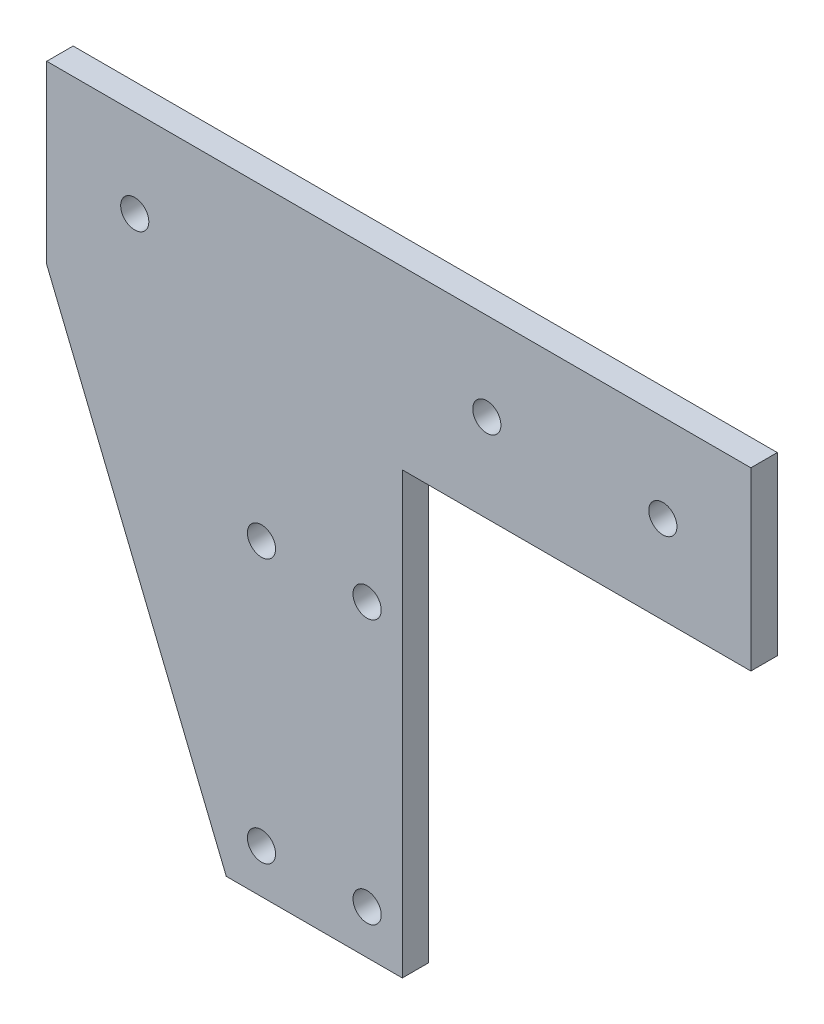
ISO-10303-21;
HEADER;
FILE_DESCRIPTION(('STEP AP214'),'2;1');
FILE_NAME('part.step','',(''),(''),'','','');
FILE_SCHEMA(('AUTOMOTIVE_DESIGN { 1 0 10303 214 1 1 1 1 }'));
ENDSEC;
DATA;
#1=APPLICATION_CONTEXT('core data for automotive mechanical design processes');
#2=APPLICATION_PROTOCOL_DEFINITION('international standard','automotive_design',2000,#1);
#3=PRODUCT_CONTEXT('',#1,'mechanical');
#4=PRODUCT('Part','Part','',(#3));
#5=PRODUCT_RELATED_PRODUCT_CATEGORY('part','',(#4));
#6=PRODUCT_DEFINITION_FORMATION('','',#4);
#7=PRODUCT_DEFINITION_CONTEXT('part definition',#1,'design');
#8=PRODUCT_DEFINITION('design','',#6,#7);
#9=PRODUCT_DEFINITION_SHAPE('','',#8);
#10=(LENGTH_UNIT() NAMED_UNIT(*) SI_UNIT(.MILLI.,.METRE.));
#11=(NAMED_UNIT(*) PLANE_ANGLE_UNIT() SI_UNIT($,.RADIAN.));
#12=(NAMED_UNIT(*) SI_UNIT($,.STERADIAN.) SOLID_ANGLE_UNIT());
#13=UNCERTAINTY_MEASURE_WITH_UNIT(LENGTH_MEASURE(1.E-05),#10,'distance_accuracy_value','');
#14=(GEOMETRIC_REPRESENTATION_CONTEXT(3) GLOBAL_UNCERTAINTY_ASSIGNED_CONTEXT((#13)) GLOBAL_UNIT_ASSIGNED_CONTEXT((#10,
#11,#12)) REPRESENTATION_CONTEXT('',''));
#15=CARTESIAN_POINT('',(0.,0.,0.));
#16=DIRECTION('',(0.,0.,1.));
#17=DIRECTION('',(1.,0.,0.));
#18=AXIS2_PLACEMENT_3D('',#15,#16,#17);
#19=CARTESIAN_POINT('',(0.,0.,3.));
#20=DIRECTION('',(0.,0.,1.));
#21=DIRECTION('',(1.,0.,0.));
#22=AXIS2_PLACEMENT_3D('',#19,#20,#21);
#23=PLANE('',#22);
#24=CARTESIAN_POINT('',(-158.458183995333,-45.,3.));
#25=DIRECTION('',(0.,0.,1.));
#26=DIRECTION('',(1.,0.,0.));
#27=AXIS2_PLACEMENT_3D('',#24,#25,#26);
#28=CIRCLE('',#27,1.59999999999999);
#29=CARTESIAN_POINT('',(-156.858183995333,-45.,3.));
#30=VERTEX_POINT('',#29);
#31=EDGE_CURVE('E190',#30,#30,#28,.T.);
#32=ORIENTED_EDGE('',*,*,#31,.F.);
#33=EDGE_LOOP('',(#32));
#34=FACE_BOUND('',#33,.T.);
#35=CARTESIAN_POINT('',(-158.458183995333,-15.,3.));
#36=DIRECTION('',(0.,0.,1.));
#37=DIRECTION('',(1.,0.,0.));
#38=AXIS2_PLACEMENT_3D('',#35,#36,#37);
#39=CIRCLE('',#38,1.59999999999999);
#40=CARTESIAN_POINT('',(-156.858183995333,-15.,3.));
#41=VERTEX_POINT('',#40);
#42=EDGE_CURVE('E178',#41,#41,#39,.T.);
#43=ORIENTED_EDGE('',*,*,#42,.F.);
#44=EDGE_LOOP('',(#43));
#45=FACE_BOUND('',#44,.T.);
#46=CARTESIAN_POINT('',(-112.858183995333,10.,3.));
#47=DIRECTION('',(0.,0.,1.));
#48=DIRECTION('',(1.,0.,0.));
#49=AXIS2_PLACEMENT_3D('',#46,#47,#48);
#50=CIRCLE('',#49,1.6);
#51=CARTESIAN_POINT('',(-111.258183995333,10.,3.));
#52=VERTEX_POINT('',#51);
#53=EDGE_CURVE('E166',#52,#52,#50,.T.);
#54=ORIENTED_EDGE('',*,*,#53,.F.);
#55=EDGE_LOOP('',(#54));
#56=FACE_BOUND('',#55,.T.);
#57=DIRECTION('',(-1.,0.,0.));
#58=VECTOR('',#57,1.);
#59=CARTESIAN_POINT('',(-102.858183995333,20.,3.));
#60=LINE('',#59,#58);
#61=CARTESIAN_POINT('',(-102.858183995333,20.,3.));
#62=VERTEX_POINT('',#61);
#63=CARTESIAN_POINT('',(-182.858183995333,20.,3.));
#64=VERTEX_POINT('',#63);
#65=EDGE_CURVE('E139',#62,#64,#60,.T.);
#66=ORIENTED_EDGE('',*,*,#65,.T.);
#67=DIRECTION('',(0.,-1.,0.));
#68=VECTOR('',#67,1.);
#69=CARTESIAN_POINT('',(-182.858183995333,20.,3.));
#70=LINE('',#69,#68);
#71=CARTESIAN_POINT('',(-182.858183995333,0.,3.));
#72=VERTEX_POINT('',#71);
#73=EDGE_CURVE('E91',#64,#72,#70,.T.);
#74=ORIENTED_EDGE('',*,*,#73,.T.);
#75=DIRECTION('',(0.377767413930531,-0.925900524339542,0.));
#76=VECTOR('',#75,1.);
#77=CARTESIAN_POINT('',(-182.858183995333,0.,3.));
#78=LINE('',#77,#76);
#79=CARTESIAN_POINT('',(-162.458183995333,-50.,3.));
#80=VERTEX_POINT('',#79);
#81=EDGE_CURVE('E151',#72,#80,#78,.T.);
#82=ORIENTED_EDGE('',*,*,#81,.T.);
#83=DIRECTION('',(1.,0.,0.));
#84=VECTOR('',#83,1.);
#85=CARTESIAN_POINT('',(-162.458183995333,-50.,3.));
#86=LINE('',#85,#84);
#87=CARTESIAN_POINT('',(-142.458183995333,-50.,3.));
#88=VERTEX_POINT('',#87);
#89=EDGE_CURVE('E107',#80,#88,#86,.T.);
#90=ORIENTED_EDGE('',*,*,#89,.T.);
#91=DIRECTION('',(0.,1.,0.));
#92=VECTOR('',#91,1.);
#93=CARTESIAN_POINT('',(-142.458183995333,0.,3.));
#94=LINE('',#93,#92);
#95=CARTESIAN_POINT('',(-142.458183995333,0.,3.));
#96=VERTEX_POINT('',#95);
#97=EDGE_CURVE('E101',#88,#96,#94,.T.);
#98=ORIENTED_EDGE('',*,*,#97,.T.);
#99=DIRECTION('',(1.,0.,0.));
#100=VECTOR('',#99,1.);
#101=CARTESIAN_POINT('',(-111.142455242795,0.,3.));
#102=LINE('',#101,#100);
#103=CARTESIAN_POINT('',(-102.858183995333,0.,3.));
#104=VERTEX_POINT('',#103);
#105=EDGE_CURVE('E105',#96,#104,#102,.T.);
#106=ORIENTED_EDGE('',*,*,#105,.T.);
#107=DIRECTION('',(0.,1.,0.));
#108=VECTOR('',#107,1.);
#109=CARTESIAN_POINT('',(-102.858183995333,0.,3.));
#110=LINE('',#109,#108);
#111=EDGE_CURVE('E52',#104,#62,#110,.T.);
#112=ORIENTED_EDGE('',*,*,#111,.T.);
#113=EDGE_LOOP('',(#66,#74,#82,#90,#98,#106,#112));
#114=FACE_BOUND('',#113,.T.);
#115=CARTESIAN_POINT('',(-172.858183995333,10.,3.));
#116=DIRECTION('',(0.,0.,1.));
#117=DIRECTION('',(1.,0.,0.));
#118=AXIS2_PLACEMENT_3D('',#115,#116,#117);
#119=CIRCLE('',#118,1.59999999999999);
#120=CARTESIAN_POINT('',(-171.258183995333,10.,3.));
#121=VERTEX_POINT('',#120);
#122=EDGE_CURVE('E130',#121,#121,#119,.T.);
#123=ORIENTED_EDGE('',*,*,#122,.F.);
#124=EDGE_LOOP('',(#123));
#125=FACE_BOUND('',#124,.T.);
#126=CARTESIAN_POINT('',(-132.858183995333,10.,3.));
#127=DIRECTION('',(0.,0.,1.));
#128=DIRECTION('',(1.,0.,0.));
#129=AXIS2_PLACEMENT_3D('',#126,#127,#128);
#130=CIRCLE('',#129,1.60000000000002);
#131=CARTESIAN_POINT('',(-131.258183995333,10.,3.));
#132=VERTEX_POINT('',#131);
#133=EDGE_CURVE('E172',#132,#132,#130,.T.);
#134=ORIENTED_EDGE('',*,*,#133,.F.);
#135=EDGE_LOOP('',(#134));
#136=FACE_BOUND('',#135,.T.);
#137=CARTESIAN_POINT('',(-146.458183995333,-15.,3.));
#138=DIRECTION('',(0.,0.,1.));
#139=DIRECTION('',(1.,0.,0.));
#140=AXIS2_PLACEMENT_3D('',#137,#138,#139);
#141=CIRCLE('',#140,1.59999999999999);
#142=CARTESIAN_POINT('',(-144.858183995333,-15.,3.));
#143=VERTEX_POINT('',#142);
#144=EDGE_CURVE('E184',#143,#143,#141,.T.);
#145=ORIENTED_EDGE('',*,*,#144,.F.);
#146=EDGE_LOOP('',(#145));
#147=FACE_BOUND('',#146,.T.);
#148=CARTESIAN_POINT('',(-146.458183995333,-45.,3.));
#149=DIRECTION('',(0.,0.,1.));
#150=DIRECTION('',(1.,0.,0.));
#151=AXIS2_PLACEMENT_3D('',#148,#149,#150);
#152=CIRCLE('',#151,1.59999999999999);
#153=CARTESIAN_POINT('',(-144.858183995333,-45.,3.));
#154=VERTEX_POINT('',#153);
#155=EDGE_CURVE('E196',#154,#154,#152,.T.);
#156=ORIENTED_EDGE('',*,*,#155,.F.);
#157=EDGE_LOOP('',(#156));
#158=FACE_BOUND('',#157,.T.);
#159=ADVANCED_FACE('F35',(#34,#45,#56,#114,#125,#136,#147,#158),#23,.T.);
#160=CARTESIAN_POINT('',(0.,0.,0.));
#161=DIRECTION('',(0.,0.,1.));
#162=DIRECTION('',(1.,0.,0.));
#163=AXIS2_PLACEMENT_3D('',#160,#161,#162);
#164=PLANE('',#163);
#165=DIRECTION('',(-1.,0.,0.));
#166=VECTOR('',#165,1.);
#167=CARTESIAN_POINT('',(-102.858183995333,20.,0.));
#168=LINE('',#167,#166);
#169=CARTESIAN_POINT('',(-102.858183995333,20.,0.));
#170=VERTEX_POINT('',#169);
#171=CARTESIAN_POINT('',(-182.858183995333,20.,0.));
#172=VERTEX_POINT('',#171);
#173=EDGE_CURVE('E126',#170,#172,#168,.T.);
#174=ORIENTED_EDGE('',*,*,#173,.F.);
#175=DIRECTION('',(0.,1.,0.));
#176=VECTOR('',#175,1.);
#177=CARTESIAN_POINT('',(-102.858183995333,0.,0.));
#178=LINE('',#177,#176);
#179=CARTESIAN_POINT('',(-102.858183995333,0.,0.));
#180=VERTEX_POINT('',#179);
#181=EDGE_CURVE('E83',#180,#170,#178,.T.);
#182=ORIENTED_EDGE('',*,*,#181,.F.);
#183=DIRECTION('',(1.,0.,0.));
#184=VECTOR('',#183,1.);
#185=CARTESIAN_POINT('',(-111.142455242795,0.,0.));
#186=LINE('',#185,#184);
#187=CARTESIAN_POINT('',(-142.458183995333,0.,0.));
#188=VERTEX_POINT('',#187);
#189=EDGE_CURVE('E77',#188,#180,#186,.T.);
#190=ORIENTED_EDGE('',*,*,#189,.F.);
#191=DIRECTION('',(0.,1.,0.));
#192=VECTOR('',#191,1.);
#193=CARTESIAN_POINT('',(-142.458183995333,0.,0.));
#194=LINE('',#193,#192);
#195=CARTESIAN_POINT('',(-142.458183995333,-50.,0.));
#196=VERTEX_POINT('',#195);
#197=EDGE_CURVE('E116',#196,#188,#194,.T.);
#198=ORIENTED_EDGE('',*,*,#197,.F.);
#199=DIRECTION('',(1.,0.,0.));
#200=VECTOR('',#199,1.);
#201=CARTESIAN_POINT('',(-162.458183995333,-50.,0.));
#202=LINE('',#201,#200);
#203=CARTESIAN_POINT('',(-162.458183995333,-50.,0.));
#204=VERTEX_POINT('',#203);
#205=EDGE_CURVE('E134',#204,#196,#202,.T.);
#206=ORIENTED_EDGE('',*,*,#205,.F.);
#207=DIRECTION('',(0.377767413930531,-0.925900524339542,0.));
#208=VECTOR('',#207,1.);
#209=CARTESIAN_POINT('',(-182.858183995333,0.,0.));
#210=LINE('',#209,#208);
#211=CARTESIAN_POINT('',(-182.858183995333,0.,0.));
#212=VERTEX_POINT('',#211);
#213=EDGE_CURVE('E132',#212,#204,#210,.T.);
#214=ORIENTED_EDGE('',*,*,#213,.F.);
#215=DIRECTION('',(0.,-1.,0.));
#216=VECTOR('',#215,1.);
#217=CARTESIAN_POINT('',(-182.858183995333,20.,0.));
#218=LINE('',#217,#216);
#219=EDGE_CURVE('E129',#172,#212,#218,.T.);
#220=ORIENTED_EDGE('',*,*,#219,.F.);
#221=EDGE_LOOP('',(#174,#182,#190,#198,#206,#214,#220));
#222=FACE_BOUND('',#221,.T.);
#223=CARTESIAN_POINT('',(-172.858183995333,10.,0.));
#224=DIRECTION('',(0.,0.,1.));
#225=DIRECTION('',(1.,0.,0.));
#226=AXIS2_PLACEMENT_3D('',#223,#224,#225);
#227=CIRCLE('',#226,1.59999999999999);
#228=CARTESIAN_POINT('',(-171.258183995333,10.,0.));
#229=VERTEX_POINT('',#228);
#230=EDGE_CURVE('E163',#229,#229,#227,.T.);
#231=ORIENTED_EDGE('',*,*,#230,.T.);
#232=EDGE_LOOP('',(#231));
#233=FACE_BOUND('',#232,.T.);
#234=CARTESIAN_POINT('',(-112.858183995333,10.,0.));
#235=DIRECTION('',(0.,0.,1.));
#236=DIRECTION('',(1.,0.,0.));
#237=AXIS2_PLACEMENT_3D('',#234,#235,#236);
#238=CIRCLE('',#237,1.6);
#239=CARTESIAN_POINT('',(-111.258183995333,10.,0.));
#240=VERTEX_POINT('',#239);
#241=EDGE_CURVE('E169',#240,#240,#238,.T.);
#242=ORIENTED_EDGE('',*,*,#241,.T.);
#243=EDGE_LOOP('',(#242));
#244=FACE_BOUND('',#243,.T.);
#245=CARTESIAN_POINT('',(-132.858183995333,10.,0.));
#246=DIRECTION('',(0.,0.,1.));
#247=DIRECTION('',(1.,0.,0.));
#248=AXIS2_PLACEMENT_3D('',#245,#246,#247);
#249=CIRCLE('',#248,1.60000000000002);
#250=CARTESIAN_POINT('',(-131.258183995333,10.,0.));
#251=VERTEX_POINT('',#250);
#252=EDGE_CURVE('E175',#251,#251,#249,.T.);
#253=ORIENTED_EDGE('',*,*,#252,.T.);
#254=EDGE_LOOP('',(#253));
#255=FACE_BOUND('',#254,.T.);
#256=CARTESIAN_POINT('',(-158.458183995333,-15.,0.));
#257=DIRECTION('',(0.,0.,1.));
#258=DIRECTION('',(1.,0.,0.));
#259=AXIS2_PLACEMENT_3D('',#256,#257,#258);
#260=CIRCLE('',#259,1.59999999999999);
#261=CARTESIAN_POINT('',(-156.858183995333,-15.,0.));
#262=VERTEX_POINT('',#261);
#263=EDGE_CURVE('E181',#262,#262,#260,.T.);
#264=ORIENTED_EDGE('',*,*,#263,.T.);
#265=EDGE_LOOP('',(#264));
#266=FACE_BOUND('',#265,.T.);
#267=CARTESIAN_POINT('',(-146.458183995333,-15.,0.));
#268=DIRECTION('',(0.,0.,1.));
#269=DIRECTION('',(1.,0.,0.));
#270=AXIS2_PLACEMENT_3D('',#267,#268,#269);
#271=CIRCLE('',#270,1.59999999999999);
#272=CARTESIAN_POINT('',(-144.858183995333,-15.,0.));
#273=VERTEX_POINT('',#272);
#274=EDGE_CURVE('E187',#273,#273,#271,.T.);
#275=ORIENTED_EDGE('',*,*,#274,.T.);
#276=EDGE_LOOP('',(#275));
#277=FACE_BOUND('',#276,.T.);
#278=CARTESIAN_POINT('',(-158.458183995333,-45.,0.));
#279=DIRECTION('',(0.,0.,1.));
#280=DIRECTION('',(1.,0.,0.));
#281=AXIS2_PLACEMENT_3D('',#278,#279,#280);
#282=CIRCLE('',#281,1.59999999999999);
#283=CARTESIAN_POINT('',(-156.858183995333,-45.,0.));
#284=VERTEX_POINT('',#283);
#285=EDGE_CURVE('E193',#284,#284,#282,.T.);
#286=ORIENTED_EDGE('',*,*,#285,.T.);
#287=EDGE_LOOP('',(#286));
#288=FACE_BOUND('',#287,.T.);
#289=CARTESIAN_POINT('',(-146.458183995333,-45.,0.));
#290=DIRECTION('',(0.,0.,1.));
#291=DIRECTION('',(1.,0.,0.));
#292=AXIS2_PLACEMENT_3D('',#289,#290,#291);
#293=CIRCLE('',#292,1.59999999999999);
#294=CARTESIAN_POINT('',(-144.858183995333,-45.,0.));
#295=VERTEX_POINT('',#294);
#296=EDGE_CURVE('E199',#295,#295,#293,.T.);
#297=ORIENTED_EDGE('',*,*,#296,.T.);
#298=EDGE_LOOP('',(#297));
#299=FACE_BOUND('',#298,.T.);
#300=ADVANCED_FACE('F155',(#222,#233,#244,#255,#266,#277,#288,#299),#164,.F.);
#301=CARTESIAN_POINT('',(-102.858183995333,20.,3.));
#302=DIRECTION('',(0.,-1.,0.));
#303=DIRECTION('',(0.,0.,-1.));
#304=AXIS2_PLACEMENT_3D('',#301,#302,#303);
#305=PLANE('',#304);
#306=ORIENTED_EDGE('',*,*,#173,.T.);
#307=DIRECTION('',(0.,0.,-1.));
#308=VECTOR('',#307,1.);
#309=CARTESIAN_POINT('',(-182.858183995333,20.,3.));
#310=LINE('',#309,#308);
#311=EDGE_CURVE('E11',#64,#172,#310,.T.);
#312=ORIENTED_EDGE('',*,*,#311,.F.);
#313=ORIENTED_EDGE('',*,*,#65,.F.);
#314=DIRECTION('',(0.,0.,-1.));
#315=VECTOR('',#314,1.);
#316=CARTESIAN_POINT('',(-102.858183995333,20.,3.));
#317=LINE('',#316,#315);
#318=EDGE_CURVE('E122',#62,#170,#317,.T.);
#319=ORIENTED_EDGE('',*,*,#318,.T.);
#320=EDGE_LOOP('',(#306,#312,#313,#319));
#321=FACE_BOUND('',#320,.T.);
#322=ADVANCED_FACE('F37',(#321),#305,.F.);
#323=CARTESIAN_POINT('',(-182.858183995333,20.,3.));
#324=DIRECTION('',(1.,0.,0.));
#325=DIRECTION('',(0.,0.,-1.));
#326=AXIS2_PLACEMENT_3D('',#323,#324,#325);
#327=PLANE('',#326);
#328=ORIENTED_EDGE('',*,*,#219,.T.);
#329=DIRECTION('',(0.,0.,-1.));
#330=VECTOR('',#329,1.);
#331=CARTESIAN_POINT('',(-182.858183995333,0.,3.));
#332=LINE('',#331,#330);
#333=EDGE_CURVE('E44',#72,#212,#332,.T.);
#334=ORIENTED_EDGE('',*,*,#333,.F.);
#335=ORIENTED_EDGE('',*,*,#73,.F.);
#336=ORIENTED_EDGE('',*,*,#311,.T.);
#337=EDGE_LOOP('',(#328,#334,#335,#336));
#338=FACE_BOUND('',#337,.T.);
#339=ADVANCED_FACE('F231',(#338),#327,.F.);
#340=CARTESIAN_POINT('',(-182.858183995333,0.,3.));
#341=DIRECTION('',(0.925900524339542,0.377767413930532,0.));
#342=DIRECTION('',(-0.377767413930532,0.925900524339542,0.));
#343=AXIS2_PLACEMENT_3D('',#340,#341,#342);
#344=PLANE('',#343);
#345=ORIENTED_EDGE('',*,*,#213,.T.);
#346=DIRECTION('',(0.,0.,-1.));
#347=VECTOR('',#346,1.);
#348=CARTESIAN_POINT('',(-162.458183995333,-50.,3.));
#349=LINE('',#348,#347);
#350=EDGE_CURVE('E143',#80,#204,#349,.T.);
#351=ORIENTED_EDGE('',*,*,#350,.F.);
#352=ORIENTED_EDGE('',*,*,#81,.F.);
#353=ORIENTED_EDGE('',*,*,#333,.T.);
#354=EDGE_LOOP('',(#345,#351,#352,#353));
#355=FACE_BOUND('',#354,.T.);
#356=ADVANCED_FACE('F149',(#355),#344,.F.);
#357=CARTESIAN_POINT('',(-162.458183995333,-50.,3.));
#358=DIRECTION('',(0.,1.,0.));
#359=DIRECTION('',(0.,0.,1.));
#360=AXIS2_PLACEMENT_3D('',#357,#358,#359);
#361=PLANE('',#360);
#362=ORIENTED_EDGE('',*,*,#205,.T.);
#363=DIRECTION('',(0.,0.,-1.));
#364=VECTOR('',#363,1.);
#365=CARTESIAN_POINT('',(-142.458183995333,-50.,3.));
#366=LINE('',#365,#364);
#367=EDGE_CURVE('E117',#88,#196,#366,.T.);
#368=ORIENTED_EDGE('',*,*,#367,.F.);
#369=ORIENTED_EDGE('',*,*,#89,.F.);
#370=ORIENTED_EDGE('',*,*,#350,.T.);
#371=EDGE_LOOP('',(#362,#368,#369,#370));
#372=FACE_BOUND('',#371,.T.);
#373=ADVANCED_FACE('F158',(#372),#361,.F.);
#374=CARTESIAN_POINT('',(-142.458183995333,0.,3.));
#375=DIRECTION('',(-1.,0.,0.));
#376=DIRECTION('',(0.,0.,1.));
#377=AXIS2_PLACEMENT_3D('',#374,#375,#376);
#378=PLANE('',#377);
#379=ORIENTED_EDGE('',*,*,#197,.T.);
#380=DIRECTION('',(0.,0.,-1.));
#381=VECTOR('',#380,1.);
#382=CARTESIAN_POINT('',(-142.458183995333,0.,3.));
#383=LINE('',#382,#381);
#384=EDGE_CURVE('E113',#96,#188,#383,.T.);
#385=ORIENTED_EDGE('',*,*,#384,.F.);
#386=ORIENTED_EDGE('',*,*,#97,.F.);
#387=ORIENTED_EDGE('',*,*,#367,.T.);
#388=EDGE_LOOP('',(#379,#385,#386,#387));
#389=FACE_BOUND('',#388,.T.);
#390=ADVANCED_FACE('F114',(#389),#378,.F.);
#391=CARTESIAN_POINT('',(-111.142455242795,0.,3.));
#392=DIRECTION('',(0.,1.,0.));
#393=DIRECTION('',(-1.,0.,0.));
#394=AXIS2_PLACEMENT_3D('',#391,#392,#393);
#395=PLANE('',#394);
#396=ORIENTED_EDGE('',*,*,#189,.T.);
#397=DIRECTION('',(0.,0.,-1.));
#398=VECTOR('',#397,1.);
#399=CARTESIAN_POINT('',(-102.858183995333,0.,3.));
#400=LINE('',#399,#398);
#401=EDGE_CURVE('E118',#104,#180,#400,.T.);
#402=ORIENTED_EDGE('',*,*,#401,.F.);
#403=ORIENTED_EDGE('',*,*,#105,.F.);
#404=ORIENTED_EDGE('',*,*,#384,.T.);
#405=EDGE_LOOP('',(#396,#402,#403,#404));
#406=FACE_BOUND('',#405,.T.);
#407=ADVANCED_FACE('F120',(#406),#395,.F.);
#408=CARTESIAN_POINT('',(-102.858183995333,0.,3.));
#409=DIRECTION('',(-1.,0.,0.));
#410=DIRECTION('',(0.,0.,1.));
#411=AXIS2_PLACEMENT_3D('',#408,#409,#410);
#412=PLANE('',#411);
#413=ORIENTED_EDGE('',*,*,#181,.T.);
#414=ORIENTED_EDGE('',*,*,#318,.F.);
#415=ORIENTED_EDGE('',*,*,#111,.F.);
#416=ORIENTED_EDGE('',*,*,#401,.T.);
#417=EDGE_LOOP('',(#413,#414,#415,#416));
#418=FACE_BOUND('',#417,.T.);
#419=ADVANCED_FACE('F221',(#418),#412,.F.);
#420=CARTESIAN_POINT('',(-172.858183995333,10.,3.));
#421=DIRECTION('',(0.,0.,-1.));
#422=DIRECTION('',(-1.,0.,0.));
#423=AXIS2_PLACEMENT_3D('',#420,#421,#422);
#424=CYLINDRICAL_SURFACE('',#423,1.59999999999999);
#425=ORIENTED_EDGE('',*,*,#122,.T.);
#426=EDGE_LOOP('',(#425));
#427=FACE_BOUND('',#426,.T.);
#428=ORIENTED_EDGE('',*,*,#230,.F.);
#429=EDGE_LOOP('',(#428));
#430=FACE_BOUND('',#429,.T.);
#431=ADVANCED_FACE('F218',(#427,#430),#424,.F.);
#432=CARTESIAN_POINT('',(-112.858183995333,10.,3.));
#433=DIRECTION('',(0.,0.,-1.));
#434=DIRECTION('',(-1.,0.,0.));
#435=AXIS2_PLACEMENT_3D('',#432,#433,#434);
#436=CYLINDRICAL_SURFACE('',#435,1.6);
#437=ORIENTED_EDGE('',*,*,#53,.T.);
#438=EDGE_LOOP('',(#437));
#439=FACE_BOUND('',#438,.T.);
#440=ORIENTED_EDGE('',*,*,#241,.F.);
#441=EDGE_LOOP('',(#440));
#442=FACE_BOUND('',#441,.T.);
#443=ADVANCED_FACE('F299',(#439,#442),#436,.F.);
#444=CARTESIAN_POINT('',(-132.858183995333,10.,3.));
#445=DIRECTION('',(0.,0.,-1.));
#446=DIRECTION('',(-1.,0.,0.));
#447=AXIS2_PLACEMENT_3D('',#444,#445,#446);
#448=CYLINDRICAL_SURFACE('',#447,1.60000000000002);
#449=ORIENTED_EDGE('',*,*,#133,.T.);
#450=EDGE_LOOP('',(#449));
#451=FACE_BOUND('',#450,.T.);
#452=ORIENTED_EDGE('',*,*,#252,.F.);
#453=EDGE_LOOP('',(#452));
#454=FACE_BOUND('',#453,.T.);
#455=ADVANCED_FACE('F307',(#451,#454),#448,.F.);
#456=CARTESIAN_POINT('',(-158.458183995333,-15.,3.));
#457=DIRECTION('',(0.,0.,-1.));
#458=DIRECTION('',(-1.,0.,0.));
#459=AXIS2_PLACEMENT_3D('',#456,#457,#458);
#460=CYLINDRICAL_SURFACE('',#459,1.59999999999999);
#461=ORIENTED_EDGE('',*,*,#42,.T.);
#462=EDGE_LOOP('',(#461));
#463=FACE_BOUND('',#462,.T.);
#464=ORIENTED_EDGE('',*,*,#263,.F.);
#465=EDGE_LOOP('',(#464));
#466=FACE_BOUND('',#465,.T.);
#467=ADVANCED_FACE('F315',(#463,#466),#460,.F.);
#468=CARTESIAN_POINT('',(-146.458183995333,-15.,3.));
#469=DIRECTION('',(0.,0.,-1.));
#470=DIRECTION('',(-1.,0.,0.));
#471=AXIS2_PLACEMENT_3D('',#468,#469,#470);
#472=CYLINDRICAL_SURFACE('',#471,1.59999999999999);
#473=ORIENTED_EDGE('',*,*,#144,.T.);
#474=EDGE_LOOP('',(#473));
#475=FACE_BOUND('',#474,.T.);
#476=ORIENTED_EDGE('',*,*,#274,.F.);
#477=EDGE_LOOP('',(#476));
#478=FACE_BOUND('',#477,.T.);
#479=ADVANCED_FACE('F324',(#475,#478),#472,.F.);
#480=CARTESIAN_POINT('',(-158.458183995333,-45.,3.));
#481=DIRECTION('',(0.,0.,-1.));
#482=DIRECTION('',(-1.,0.,0.));
#483=AXIS2_PLACEMENT_3D('',#480,#481,#482);
#484=CYLINDRICAL_SURFACE('',#483,1.59999999999999);
#485=ORIENTED_EDGE('',*,*,#31,.T.);
#486=EDGE_LOOP('',(#485));
#487=FACE_BOUND('',#486,.T.);
#488=ORIENTED_EDGE('',*,*,#285,.F.);
#489=EDGE_LOOP('',(#488));
#490=FACE_BOUND('',#489,.T.);
#491=ADVANCED_FACE('F333',(#487,#490),#484,.F.);
#492=CARTESIAN_POINT('',(-146.458183995333,-45.,3.));
#493=DIRECTION('',(0.,0.,-1.));
#494=DIRECTION('',(-1.,0.,0.));
#495=AXIS2_PLACEMENT_3D('',#492,#493,#494);
#496=CYLINDRICAL_SURFACE('',#495,1.59999999999999);
#497=ORIENTED_EDGE('',*,*,#155,.T.);
#498=EDGE_LOOP('',(#497));
#499=FACE_BOUND('',#498,.T.);
#500=ORIENTED_EDGE('',*,*,#296,.F.);
#501=EDGE_LOOP('',(#500));
#502=FACE_BOUND('',#501,.T.);
#503=ADVANCED_FACE('F205',(#499,#502),#496,.F.);
#504=CLOSED_SHELL('',(#159,#300,#322,#339,#356,#373,#390,#407,#419,#431,#443,#455,#467,#479,
#491,#503));
#505=MANIFOLD_SOLID_BREP('B2',#504);
#506=ADVANCED_BREP_SHAPE_REPRESENTATION('',(#18,#505),#14);
#507=SHAPE_DEFINITION_REPRESENTATION(#9,#506);
ENDSEC;
END-ISO-10303-21;
